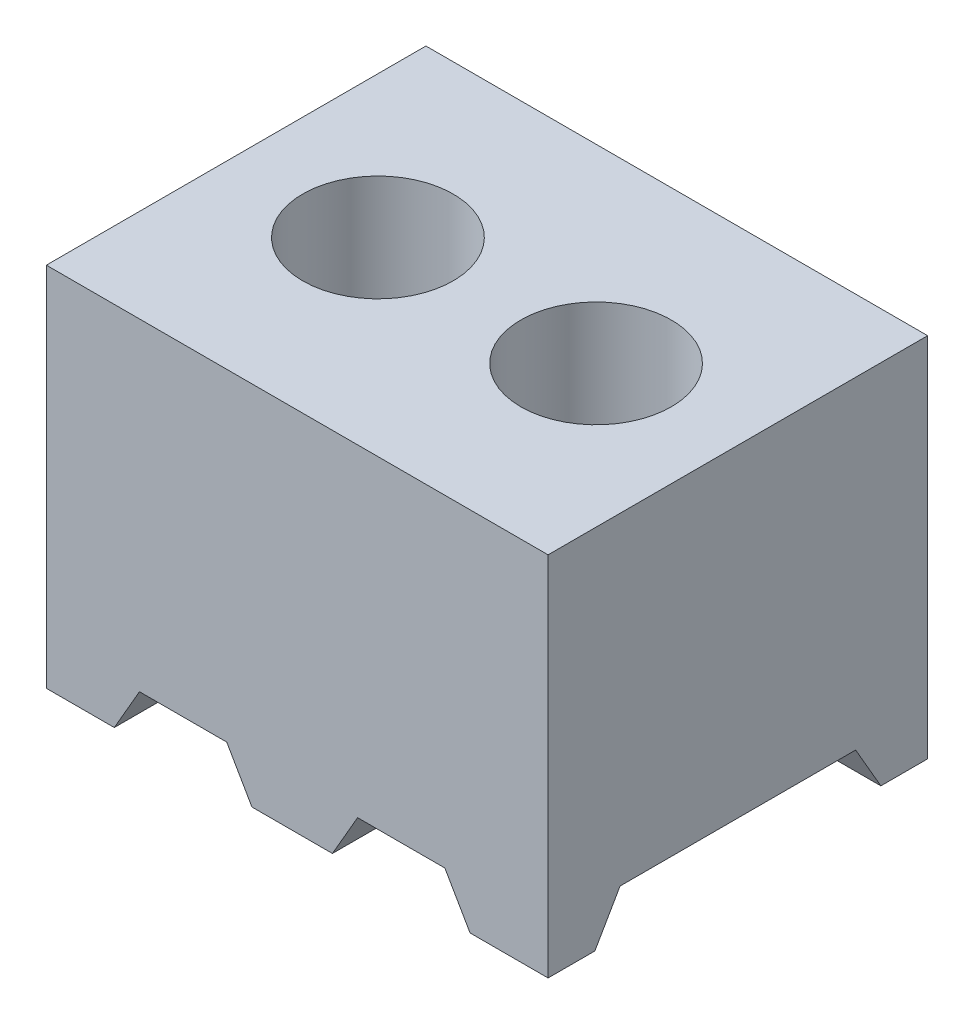
ISO-10303-21;
HEADER;
FILE_DESCRIPTION(('STEP AP214'),'2;1');
FILE_NAME('part.step','',(''),(''),'','','');
FILE_SCHEMA(('AUTOMOTIVE_DESIGN { 1 0 10303 214 1 1 1 1 }'));
ENDSEC;
DATA;
#1=APPLICATION_CONTEXT('core data for automotive mechanical design processes');
#2=APPLICATION_PROTOCOL_DEFINITION('international standard','automotive_design',2000,#1);
#3=PRODUCT_CONTEXT('',#1,'mechanical');
#4=PRODUCT('Part','Part','',(#3));
#5=PRODUCT_RELATED_PRODUCT_CATEGORY('part','',(#4));
#6=PRODUCT_DEFINITION_FORMATION('','',#4);
#7=PRODUCT_DEFINITION_CONTEXT('part definition',#1,'design');
#8=PRODUCT_DEFINITION('design','',#6,#7);
#9=PRODUCT_DEFINITION_SHAPE('','',#8);
#10=(LENGTH_UNIT() NAMED_UNIT(*) SI_UNIT(.MILLI.,.METRE.));
#11=(NAMED_UNIT(*) PLANE_ANGLE_UNIT() SI_UNIT($,.RADIAN.));
#12=(NAMED_UNIT(*) SI_UNIT($,.STERADIAN.) SOLID_ANGLE_UNIT());
#13=UNCERTAINTY_MEASURE_WITH_UNIT(LENGTH_MEASURE(1.E-05),#10,'distance_accuracy_value','');
#14=(GEOMETRIC_REPRESENTATION_CONTEXT(3) GLOBAL_UNCERTAINTY_ASSIGNED_CONTEXT((#13)) GLOBAL_UNIT_ASSIGNED_CONTEXT((#10,
#11,#12)) REPRESENTATION_CONTEXT('',''));
#15=CARTESIAN_POINT('',(0.,0.,0.));
#16=DIRECTION('',(0.,0.,1.));
#17=DIRECTION('',(1.,0.,0.));
#18=AXIS2_PLACEMENT_3D('',#15,#16,#17);
#19=CARTESIAN_POINT('',(0.,-2.1336,0.));
#20=DIRECTION('',(0.,1.,0.));
#21=DIRECTION('',(0.,0.,1.));
#22=AXIS2_PLACEMENT_3D('',#19,#20,#21);
#23=PLANE('',#22);
#24=DIRECTION('',(1.,0.,0.));
#25=VECTOR('',#24,1.);
#26=CARTESIAN_POINT('',(0.,-2.1336,0.));
#27=LINE('',#26,#25);
#28=CARTESIAN_POINT('',(2.46681757469933,-2.1336,0.));
#29=VERTEX_POINT('',#28);
#30=CARTESIAN_POINT('',(2.92099999999999,-2.1336,0.));
#31=VERTEX_POINT('',#30);
#32=EDGE_CURVE('E311',#29,#31,#27,.T.);
#33=ORIENTED_EDGE('',*,*,#32,.F.);
#34=DIRECTION('',(0.,0.,1.));
#35=VECTOR('',#34,1.);
#36=CARTESIAN_POINT('',(2.46681757469933,-2.1336,-2.2098));
#37=LINE('',#36,#35);
#38=CARTESIAN_POINT('',(2.46681757469933,-2.1336,-0.272453031625834));
#39=VERTEX_POINT('',#38);
#40=EDGE_CURVE('E215',#39,#29,#37,.T.);
#41=ORIENTED_EDGE('',*,*,#40,.F.);
#42=DIRECTION('',(1.,0.,0.));
#43=VECTOR('',#42,1.);
#44=CARTESIAN_POINT('',(0.,-2.1336,-0.272453031625834));
#45=LINE('',#44,#43);
#46=CARTESIAN_POINT('',(2.92099999999999,-2.1336,-0.272453031625834));
#47=VERTEX_POINT('',#46);
#48=EDGE_CURVE('E25',#39,#47,#45,.T.);
#49=ORIENTED_EDGE('',*,*,#48,.T.);
#50=DIRECTION('',(0.,0.,-1.));
#51=VECTOR('',#50,1.);
#52=CARTESIAN_POINT('',(2.92099999999999,-2.1336,0.));
#53=LINE('',#52,#51);
#54=EDGE_CURVE('E318',#31,#47,#53,.T.);
#55=ORIENTED_EDGE('',*,*,#54,.F.);
#56=EDGE_LOOP('',(#33,#41,#49,#55));
#57=FACE_BOUND('',#56,.T.);
#58=ADVANCED_FACE('F16',(#57),#23,.F.);
#59=DIRECTION('',(-1.,0.,0.));
#60=VECTOR('',#59,1.);
#61=CARTESIAN_POINT('',(0.,-2.1336,-1.93734696837416));
#62=LINE('',#61,#60);
#63=CARTESIAN_POINT('',(2.92099999999999,-2.1336,-1.93734696837416));
#64=VERTEX_POINT('',#63);
#65=CARTESIAN_POINT('',(2.46681757469933,-2.1336,-1.93734696837416));
#66=VERTEX_POINT('',#65);
#67=EDGE_CURVE('E344',#64,#66,#62,.T.);
#68=ORIENTED_EDGE('',*,*,#67,.T.);
#69=CARTESIAN_POINT('',(2.46681757469933,-2.1336,-2.2098));
#70=VERTEX_POINT('',#69);
#71=EDGE_CURVE('E213',#70,#66,#37,.T.);
#72=ORIENTED_EDGE('',*,*,#71,.F.);
#73=DIRECTION('',(-1.,0.,0.));
#74=VECTOR('',#73,1.);
#75=CARTESIAN_POINT('',(2.92099999999999,-2.1336,-2.20979999999999));
#76=LINE('',#75,#74);
#77=CARTESIAN_POINT('',(2.92099999999999,-2.1336,-2.20979999999999));
#78=VERTEX_POINT('',#77);
#79=EDGE_CURVE('E322',#78,#70,#76,.T.);
#80=ORIENTED_EDGE('',*,*,#79,.F.);
#81=EDGE_CURVE('E316',#64,#78,#53,.T.);
#82=ORIENTED_EDGE('',*,*,#81,.F.);
#83=EDGE_LOOP('',(#68,#72,#80,#82));
#84=FACE_BOUND('',#83,.T.);
#85=ADVANCED_FACE('F396',(#84),#23,.F.);
#86=CARTESIAN_POINT('',(-60.96,-1.8796,-0.4191));
#87=DIRECTION('',(0.,0.500000000000004,0.866025403784436));
#88=DIRECTION('',(0.,-0.866025403784436,0.500000000000004));
#89=AXIS2_PLACEMENT_3D('',#86,#87,#88);
#90=PLANE('',#89);
#91=ORIENTED_EDGE('',*,*,#48,.F.);
#92=DIRECTION('',(-0.447213595499954,0.774596669241483,-0.447213595499962));
#93=VECTOR('',#92,1.);
#94=CARTESIAN_POINT('',(-10.3358635149396,20.0412941203562,-13.075134121265));
#95=LINE('',#94,#93);
#96=CARTESIAN_POINT('',(2.32017060632517,-1.8796,-0.4191));
#97=VERTEX_POINT('',#96);
#98=EDGE_CURVE('E224',#39,#97,#95,.T.);
#99=ORIENTED_EDGE('',*,*,#98,.T.);
#100=DIRECTION('',(1.,0.,0.));
#101=VECTOR('',#100,1.);
#102=CARTESIAN_POINT('',(-60.96,-1.8796,-0.4191));
#103=LINE('',#102,#101);
#104=CARTESIAN_POINT('',(2.92099999999999,-1.8796,-0.4191));
#105=VERTEX_POINT('',#104);
#106=EDGE_CURVE('E297',#97,#105,#103,.T.);
#107=ORIENTED_EDGE('',*,*,#106,.T.);
#108=DIRECTION('',(0.,-0.866025403784436,0.500000000000004));
#109=VECTOR('',#108,1.);
#110=CARTESIAN_POINT('',(2.92099999999999,-1.8796,-0.4191));
#111=LINE('',#110,#109);
#112=EDGE_CURVE('E282',#105,#47,#111,.T.);
#113=ORIENTED_EDGE('',*,*,#112,.T.);
#114=EDGE_LOOP('',(#91,#99,#107,#113));
#115=FACE_BOUND('',#114,.T.);
#116=ADVANCED_FACE('F402',(#115),#90,.F.);
#117=CARTESIAN_POINT('',(-60.96,-1.8796,-1.7907));
#118=DIRECTION('',(0.,0.499999999999978,-0.866025403784451));
#119=DIRECTION('',(0.,0.866025403784451,0.499999999999978));
#120=AXIS2_PLACEMENT_3D('',#117,#118,#119);
#121=PLANE('',#120);
#122=DIRECTION('',(1.,0.,0.));
#123=VECTOR('',#122,1.);
#124=CARTESIAN_POINT('',(-60.96,-1.8796,-1.7907));
#125=LINE('',#124,#123);
#126=CARTESIAN_POINT('',(2.32017060632517,-1.8796,-1.7907));
#127=VERTEX_POINT('',#126);
#128=CARTESIAN_POINT('',(2.92099999999999,-1.8796,-1.7907));
#129=VERTEX_POINT('',#128);
#130=EDGE_CURVE('E291',#127,#129,#125,.T.);
#131=ORIENTED_EDGE('',*,*,#130,.F.);
#132=DIRECTION('',(0.44721359549996,-0.774596669241494,-0.447213595499938));
#133=VECTOR('',#132,1.);
#134=CARTESIAN_POINT('',(-10.33586351494,20.0412941203568,10.8653341212645));
#135=LINE('',#134,#133);
#136=EDGE_CURVE('E221',#127,#66,#135,.T.);
#137=ORIENTED_EDGE('',*,*,#136,.T.);
#138=ORIENTED_EDGE('',*,*,#67,.F.);
#139=DIRECTION('',(0.,0.866025403784451,0.499999999999978));
#140=VECTOR('',#139,1.);
#141=CARTESIAN_POINT('',(2.92099999999999,-1.8796,-1.7907));
#142=LINE('',#141,#140);
#143=EDGE_CURVE('E285',#64,#129,#142,.T.);
#144=ORIENTED_EDGE('',*,*,#143,.T.);
#145=EDGE_LOOP('',(#131,#137,#138,#144));
#146=FACE_BOUND('',#145,.T.);
#147=ADVANCED_FACE('F427',(#146),#121,.F.);
#148=CARTESIAN_POINT('',(1.19681757469933,-2.1336,-0.272453031625834));
#149=VERTEX_POINT('',#148);
#150=CARTESIAN_POINT('',(1.665523637951,-2.1336,-0.272453031625838));
#151=VERTEX_POINT('',#150);
#152=EDGE_CURVE('E24',#149,#151,#45,.T.);
#153=ORIENTED_EDGE('',*,*,#152,.T.);
#154=DIRECTION('',(0.,0.,1.));
#155=VECTOR('',#154,1.);
#156=CARTESIAN_POINT('',(1.665523637951,-2.1336,-2.2098));
#157=LINE('',#156,#155);
#158=CARTESIAN_POINT('',(1.665523637951,-2.1336,0.));
#159=VERTEX_POINT('',#158);
#160=EDGE_CURVE('E189',#151,#159,#157,.T.);
#161=ORIENTED_EDGE('',*,*,#160,.T.);
#162=CARTESIAN_POINT('',(1.19681757469933,-2.1336,0.));
#163=VERTEX_POINT('',#162);
#164=EDGE_CURVE('E317',#163,#159,#27,.T.);
#165=ORIENTED_EDGE('',*,*,#164,.F.);
#166=DIRECTION('',(0.,0.,1.));
#167=VECTOR('',#166,1.);
#168=CARTESIAN_POINT('',(1.19681757469933,-2.1336,-2.2098));
#169=LINE('',#168,#167);
#170=EDGE_CURVE('E252',#149,#163,#169,.T.);
#171=ORIENTED_EDGE('',*,*,#170,.F.);
#172=EDGE_LOOP('',(#153,#161,#165,#171));
#173=FACE_BOUND('',#172,.T.);
#174=ADVANCED_FACE('F403',(#173),#23,.F.);
#175=CARTESIAN_POINT('',(1.665523637951,-2.1336,-2.2098));
#176=VERTEX_POINT('',#175);
#177=CARTESIAN_POINT('',(1.19681757469933,-2.1336,-2.2098));
#178=VERTEX_POINT('',#177);
#179=EDGE_CURVE('E325',#176,#178,#76,.T.);
#180=ORIENTED_EDGE('',*,*,#179,.F.);
#181=CARTESIAN_POINT('',(1.665523637951,-2.1336,-1.93734696837416));
#182=VERTEX_POINT('',#181);
#183=EDGE_CURVE('E32',#176,#182,#157,.T.);
#184=ORIENTED_EDGE('',*,*,#183,.T.);
#185=CARTESIAN_POINT('',(1.19681757469933,-2.1336,-1.93734696837416));
#186=VERTEX_POINT('',#185);
#187=EDGE_CURVE('E346',#182,#186,#62,.T.);
#188=ORIENTED_EDGE('',*,*,#187,.T.);
#189=EDGE_CURVE('E249',#178,#186,#169,.T.);
#190=ORIENTED_EDGE('',*,*,#189,.F.);
#191=EDGE_LOOP('',(#180,#184,#188,#190));
#192=FACE_BOUND('',#191,.T.);
#193=ADVANCED_FACE('F373',(#192),#23,.F.);
#194=CARTESIAN_POINT('',(1.05017060632517,-1.8796,-0.4191));
#195=VERTEX_POINT('',#194);
#196=CARTESIAN_POINT('',(1.81217060632517,-1.8796,-0.4191));
#197=VERTEX_POINT('',#196);
#198=EDGE_CURVE('E296',#195,#197,#103,.T.);
#199=ORIENTED_EDGE('',*,*,#198,.T.);
#200=DIRECTION('',(-0.447213595499954,-0.774596669241483,0.447213595499963));
#201=VECTOR('',#200,1.);
#202=CARTESIAN_POINT('',(-10.7422635149396,-23.6245177583072,12.135334121265));
#203=LINE('',#202,#201);
#204=EDGE_CURVE('E218',#197,#151,#203,.T.);
#205=ORIENTED_EDGE('',*,*,#204,.T.);
#206=ORIENTED_EDGE('',*,*,#152,.F.);
#207=DIRECTION('',(-0.447213595499954,0.774596669241483,-0.447213595499962));
#208=VECTOR('',#207,1.);
#209=CARTESIAN_POINT('',(-11.3518635149396,19.6013532152337,-12.8211341212651));
#210=LINE('',#209,#208);
#211=EDGE_CURVE('E267',#149,#195,#210,.T.);
#212=ORIENTED_EDGE('',*,*,#211,.T.);
#213=EDGE_LOOP('',(#199,#205,#206,#212));
#214=FACE_BOUND('',#213,.T.);
#215=ADVANCED_FACE('F425',(#214),#90,.F.);
#216=ORIENTED_EDGE('',*,*,#187,.F.);
#217=DIRECTION('',(0.44721359549996,0.774596669241494,0.447213595499938));
#218=VECTOR('',#217,1.);
#219=CARTESIAN_POINT('',(-10.74226351494,-23.6245177583078,-14.3451341212645));
#220=LINE('',#219,#218);
#221=CARTESIAN_POINT('',(1.81217060632517,-1.8796,-1.7907));
#222=VERTEX_POINT('',#221);
#223=EDGE_CURVE('E211',#182,#222,#220,.T.);
#224=ORIENTED_EDGE('',*,*,#223,.T.);
#225=CARTESIAN_POINT('',(1.05017060632517,-1.8796,-1.7907));
#226=VERTEX_POINT('',#225);
#227=EDGE_CURVE('E187',#226,#222,#125,.T.);
#228=ORIENTED_EDGE('',*,*,#227,.F.);
#229=DIRECTION('',(0.44721359549996,-0.774596669241494,-0.447213595499938));
#230=VECTOR('',#229,1.);
#231=CARTESIAN_POINT('',(-11.35186351494,19.6013532152343,10.6113341212645));
#232=LINE('',#231,#230);
#233=EDGE_CURVE('E264',#226,#186,#232,.T.);
#234=ORIENTED_EDGE('',*,*,#233,.T.);
#235=EDGE_LOOP('',(#216,#224,#228,#234));
#236=FACE_BOUND('',#235,.T.);
#237=ADVANCED_FACE('F376',(#236),#121,.F.);
#238=CARTESIAN_POINT('',(0.,-2.1336,-0.272453031625834));
#239=VERTEX_POINT('',#238);
#240=CARTESIAN_POINT('',(0.395523637951008,-2.1336,-0.272453031625833));
#241=VERTEX_POINT('',#240);
#242=EDGE_CURVE('E10',#239,#241,#45,.T.);
#243=ORIENTED_EDGE('',*,*,#242,.T.);
#244=DIRECTION('',(0.,0.,1.));
#245=VECTOR('',#244,1.);
#246=CARTESIAN_POINT('',(0.395523637951004,-2.1336,-2.2098));
#247=LINE('',#246,#245);
#248=CARTESIAN_POINT('',(0.395523637951004,-2.1336,0.));
#249=VERTEX_POINT('',#248);
#250=EDGE_CURVE('E256',#241,#249,#247,.T.);
#251=ORIENTED_EDGE('',*,*,#250,.T.);
#252=CARTESIAN_POINT('',(0.,-2.1336,0.));
#253=VERTEX_POINT('',#252);
#254=EDGE_CURVE('E313',#253,#249,#27,.T.);
#255=ORIENTED_EDGE('',*,*,#254,.F.);
#256=DIRECTION('',(0.,0.,1.));
#257=VECTOR('',#256,1.);
#258=CARTESIAN_POINT('',(0.,-2.1336,-2.2098));
#259=LINE('',#258,#257);
#260=EDGE_CURVE('E312',#239,#253,#259,.T.);
#261=ORIENTED_EDGE('',*,*,#260,.F.);
#262=EDGE_LOOP('',(#243,#251,#255,#261));
#263=FACE_BOUND('',#262,.T.);
#264=ADVANCED_FACE('F410',(#263),#23,.F.);
#265=CARTESIAN_POINT('',(0.,-2.1336,-2.2098));
#266=DIRECTION('',(-1.,0.,0.));
#267=DIRECTION('',(0.,0.,1.));
#268=AXIS2_PLACEMENT_3D('',#265,#266,#267);
#269=PLANE('',#268);
#270=DIRECTION('',(0.,0.866025403784436,-0.500000000000004));
#271=VECTOR('',#270,1.);
#272=CARTESIAN_POINT('',(0.,-1.2947041547216,-0.756789773719383));
#273=LINE('',#272,#271);
#274=CARTESIAN_POINT('',(0.,-1.8796,-0.4191));
#275=VERTEX_POINT('',#274);
#276=EDGE_CURVE('E303',#239,#275,#273,.T.);
#277=ORIENTED_EDGE('',*,*,#276,.F.);
#278=ORIENTED_EDGE('',*,*,#260,.T.);
#279=DIRECTION('',(0.,1.,0.));
#280=VECTOR('',#279,1.);
#281=CARTESIAN_POINT('',(0.,-2.1336,0.));
#282=LINE('',#281,#280);
#283=CARTESIAN_POINT('',(0.,0.,0.));
#284=VERTEX_POINT('',#283);
#285=EDGE_CURVE('E324',#253,#284,#282,.T.);
#286=ORIENTED_EDGE('',*,*,#285,.T.);
#287=DIRECTION('',(0.,0.,1.));
#288=VECTOR('',#287,1.);
#289=CARTESIAN_POINT('',(0.,0.,-2.2098));
#290=LINE('',#289,#288);
#291=CARTESIAN_POINT('',(0.,0.,-2.2098));
#292=VERTEX_POINT('',#291);
#293=EDGE_CURVE('E307',#292,#284,#290,.T.);
#294=ORIENTED_EDGE('',*,*,#293,.F.);
#295=DIRECTION('',(0.,1.,0.));
#296=VECTOR('',#295,1.);
#297=CARTESIAN_POINT('',(0.,-2.1336,-2.2098));
#298=LINE('',#297,#296);
#299=CARTESIAN_POINT('',(0.,-2.1336,-2.2098));
#300=VERTEX_POINT('',#299);
#301=EDGE_CURVE('E337',#300,#292,#298,.T.);
#302=ORIENTED_EDGE('',*,*,#301,.F.);
#303=CARTESIAN_POINT('',(0.,-2.1336,-1.93734696837416));
#304=VERTEX_POINT('',#303);
#305=EDGE_CURVE('E308',#300,#304,#259,.T.);
#306=ORIENTED_EDGE('',*,*,#305,.T.);
#307=DIRECTION('',(0.,-0.866025403784451,-0.499999999999978));
#308=VECTOR('',#307,1.);
#309=CARTESIAN_POINT('',(0.,-2.25157562336303,-2.00546022628061));
#310=LINE('',#309,#308);
#311=CARTESIAN_POINT('',(0.,-1.8796,-1.7907));
#312=VERTEX_POINT('',#311);
#313=EDGE_CURVE('E295',#312,#304,#310,.T.);
#314=ORIENTED_EDGE('',*,*,#313,.F.);
#315=DIRECTION('',(0.,0.,-1.));
#316=VECTOR('',#315,1.);
#317=CARTESIAN_POINT('',(0.,-1.8796,-2.2098));
#318=LINE('',#317,#316);
#319=EDGE_CURVE('E305',#275,#312,#318,.T.);
#320=ORIENTED_EDGE('',*,*,#319,.F.);
#321=EDGE_LOOP('',(#277,#278,#286,#294,#302,#306,#314,#320));
#322=FACE_BOUND('',#321,.T.);
#323=ADVANCED_FACE('F18',(#322),#269,.T.);
#324=CARTESIAN_POINT('',(2.92099999999999,-2.1336,-2.20979999999999));
#325=DIRECTION('',(0.,0.,-1.));
#326=DIRECTION('',(-1.,0.,0.));
#327=AXIS2_PLACEMENT_3D('',#324,#325,#326);
#328=PLANE('',#327);
#329=DIRECTION('',(-0.499999999999997,0.86602540378444,0.));
#330=VECTOR('',#329,1.);
#331=CARTESIAN_POINT('',(2.46681757469933,-2.1336,-2.2098));
#332=LINE('',#331,#330);
#333=CARTESIAN_POINT('',(2.32017060632517,-1.8796,-2.2098));
#334=VERTEX_POINT('',#333);
#335=EDGE_CURVE('E196',#70,#334,#332,.T.);
#336=ORIENTED_EDGE('',*,*,#335,.T.);
#337=DIRECTION('',(-1.,0.,0.));
#338=VECTOR('',#337,1.);
#339=CARTESIAN_POINT('',(1.81217060632517,-1.8796,-2.2098));
#340=LINE('',#339,#338);
#341=CARTESIAN_POINT('',(1.81217060632517,-1.8796,-2.2098));
#342=VERTEX_POINT('',#341);
#343=EDGE_CURVE('E183',#334,#342,#340,.T.);
#344=ORIENTED_EDGE('',*,*,#343,.T.);
#345=DIRECTION('',(-0.499999999999996,-0.866025403784441,0.));
#346=VECTOR('',#345,1.);
#347=CARTESIAN_POINT('',(1.665523637951,-2.1336,-2.2098));
#348=LINE('',#347,#346);
#349=EDGE_CURVE('E192',#342,#176,#348,.T.);
#350=ORIENTED_EDGE('',*,*,#349,.T.);
#351=ORIENTED_EDGE('',*,*,#179,.T.);
#352=DIRECTION('',(-0.499999999999997,0.86602540378444,0.));
#353=VECTOR('',#352,1.);
#354=CARTESIAN_POINT('',(1.19681757469933,-2.1336,-2.2098));
#355=LINE('',#354,#353);
#356=CARTESIAN_POINT('',(1.05017060632517,-1.8796,-2.2098));
#357=VERTEX_POINT('',#356);
#358=EDGE_CURVE('E235',#178,#357,#355,.T.);
#359=ORIENTED_EDGE('',*,*,#358,.T.);
#360=DIRECTION('',(-1.,0.,0.));
#361=VECTOR('',#360,1.);
#362=CARTESIAN_POINT('',(0.542170606325168,-1.8796,-2.2098));
#363=LINE('',#362,#361);
#364=CARTESIAN_POINT('',(0.542170606325168,-1.8796,-2.2098));
#365=VERTEX_POINT('',#364);
#366=EDGE_CURVE('E228',#357,#365,#363,.T.);
#367=ORIENTED_EDGE('',*,*,#366,.T.);
#368=DIRECTION('',(-0.499999999999996,-0.866025403784441,0.));
#369=VECTOR('',#368,1.);
#370=CARTESIAN_POINT('',(0.395523637951004,-2.1336,-2.2098));
#371=LINE('',#370,#369);
#372=CARTESIAN_POINT('',(0.395523637951004,-2.1336,-2.2098));
#373=VERTEX_POINT('',#372);
#374=EDGE_CURVE('E231',#365,#373,#371,.T.);
#375=ORIENTED_EDGE('',*,*,#374,.T.);
#376=EDGE_CURVE('E321',#373,#300,#76,.T.);
#377=ORIENTED_EDGE('',*,*,#376,.T.);
#378=ORIENTED_EDGE('',*,*,#301,.T.);
#379=DIRECTION('',(-1.,0.,0.));
#380=VECTOR('',#379,1.);
#381=CARTESIAN_POINT('',(2.92099999999999,0.,-2.20979999999999));
#382=LINE('',#381,#380);
#383=CARTESIAN_POINT('',(2.92099999999999,0.,-2.20979999999999));
#384=VERTEX_POINT('',#383);
#385=EDGE_CURVE('E334',#384,#292,#382,.T.);
#386=ORIENTED_EDGE('',*,*,#385,.F.);
#387=DIRECTION('',(0.,1.,0.));
#388=VECTOR('',#387,1.);
#389=CARTESIAN_POINT('',(2.92099999999999,-2.1336,-2.20979999999999));
#390=LINE('',#389,#388);
#391=EDGE_CURVE('E340',#78,#384,#390,.T.);
#392=ORIENTED_EDGE('',*,*,#391,.F.);
#393=ORIENTED_EDGE('',*,*,#79,.T.);
#394=EDGE_LOOP('',(#336,#344,#350,#351,#359,#367,#375,#377,#378,#386,#392,#393));
#395=FACE_BOUND('',#394,.T.);
#396=ADVANCED_FACE('F198',(#395),#328,.T.);
#397=CARTESIAN_POINT('',(2.92099999999999,-2.1336,0.));
#398=DIRECTION('',(1.,0.,0.));
#399=DIRECTION('',(0.,0.,-1.));
#400=AXIS2_PLACEMENT_3D('',#397,#398,#399);
#401=PLANE('',#400);
#402=ORIENTED_EDGE('',*,*,#112,.F.);
#403=DIRECTION('',(0.,0.,1.));
#404=VECTOR('',#403,1.);
#405=CARTESIAN_POINT('',(2.92099999999999,-1.8796,-0.4191));
#406=LINE('',#405,#404);
#407=EDGE_CURVE('E288',#129,#105,#406,.T.);
#408=ORIENTED_EDGE('',*,*,#407,.F.);
#409=ORIENTED_EDGE('',*,*,#143,.F.);
#410=ORIENTED_EDGE('',*,*,#81,.T.);
#411=ORIENTED_EDGE('',*,*,#391,.T.);
#412=DIRECTION('',(0.,0.,-1.));
#413=VECTOR('',#412,1.);
#414=CARTESIAN_POINT('',(2.92099999999999,0.,0.));
#415=LINE('',#414,#413);
#416=CARTESIAN_POINT('',(2.92099999999999,0.,0.));
#417=VERTEX_POINT('',#416);
#418=EDGE_CURVE('E331',#417,#384,#415,.T.);
#419=ORIENTED_EDGE('',*,*,#418,.F.);
#420=DIRECTION('',(0.,1.,0.));
#421=VECTOR('',#420,1.);
#422=CARTESIAN_POINT('',(2.92099999999999,-2.1336,0.));
#423=LINE('',#422,#421);
#424=EDGE_CURVE('E342',#31,#417,#423,.T.);
#425=ORIENTED_EDGE('',*,*,#424,.F.);
#426=ORIENTED_EDGE('',*,*,#54,.T.);
#427=EDGE_LOOP('',(#402,#408,#409,#410,#411,#419,#425,#426));
#428=FACE_BOUND('',#427,.T.);
#429=ADVANCED_FACE('F417',(#428),#401,.T.);
#430=CARTESIAN_POINT('',(0.,-2.1336,0.));
#431=DIRECTION('',(0.,0.,1.));
#432=DIRECTION('',(1.,0.,0.));
#433=AXIS2_PLACEMENT_3D('',#430,#431,#432);
#434=PLANE('',#433);
#435=DIRECTION('',(-0.499999999999997,0.86602540378444,0.));
#436=VECTOR('',#435,1.);
#437=CARTESIAN_POINT('',(2.46681757469933,-2.1336,0.));
#438=LINE('',#437,#436);
#439=CARTESIAN_POINT('',(2.32017060632517,-1.8796,0.));
#440=VERTEX_POINT('',#439);
#441=EDGE_CURVE('E200',#29,#440,#438,.T.);
#442=ORIENTED_EDGE('',*,*,#441,.F.);
#443=ORIENTED_EDGE('',*,*,#32,.T.);
#444=ORIENTED_EDGE('',*,*,#424,.T.);
#445=DIRECTION('',(1.,0.,0.));
#446=VECTOR('',#445,1.);
#447=CARTESIAN_POINT('',(0.,0.,0.));
#448=LINE('',#447,#446);
#449=EDGE_CURVE('E328',#284,#417,#448,.T.);
#450=ORIENTED_EDGE('',*,*,#449,.F.);
#451=ORIENTED_EDGE('',*,*,#285,.F.);
#452=ORIENTED_EDGE('',*,*,#254,.T.);
#453=DIRECTION('',(-0.499999999999996,-0.866025403784441,0.));
#454=VECTOR('',#453,1.);
#455=CARTESIAN_POINT('',(0.395523637951004,-2.1336,0.));
#456=LINE('',#455,#454);
#457=CARTESIAN_POINT('',(0.542170606325168,-1.8796,0.));
#458=VERTEX_POINT('',#457);
#459=EDGE_CURVE('E241',#458,#249,#456,.T.);
#460=ORIENTED_EDGE('',*,*,#459,.F.);
#461=DIRECTION('',(-1.,0.,0.));
#462=VECTOR('',#461,1.);
#463=CARTESIAN_POINT('',(0.542170606325168,-1.8796,0.));
#464=LINE('',#463,#462);
#465=CARTESIAN_POINT('',(1.05017060632517,-1.8796,0.));
#466=VERTEX_POINT('',#465);
#467=EDGE_CURVE('E227',#466,#458,#464,.T.);
#468=ORIENTED_EDGE('',*,*,#467,.F.);
#469=DIRECTION('',(-0.499999999999997,0.86602540378444,0.));
#470=VECTOR('',#469,1.);
#471=CARTESIAN_POINT('',(1.19681757469933,-2.1336,0.));
#472=LINE('',#471,#470);
#473=EDGE_CURVE('E232',#163,#466,#472,.T.);
#474=ORIENTED_EDGE('',*,*,#473,.F.);
#475=ORIENTED_EDGE('',*,*,#164,.T.);
#476=DIRECTION('',(-0.499999999999996,-0.866025403784441,0.));
#477=VECTOR('',#476,1.);
#478=CARTESIAN_POINT('',(1.665523637951,-2.1336,0.));
#479=LINE('',#478,#477);
#480=CARTESIAN_POINT('',(1.81217060632517,-1.8796,0.));
#481=VERTEX_POINT('',#480);
#482=EDGE_CURVE('E203',#481,#159,#479,.T.);
#483=ORIENTED_EDGE('',*,*,#482,.F.);
#484=DIRECTION('',(-1.,0.,0.));
#485=VECTOR('',#484,1.);
#486=CARTESIAN_POINT('',(1.81217060632517,-1.8796,0.));
#487=LINE('',#486,#485);
#488=EDGE_CURVE('E40',#440,#481,#487,.T.);
#489=ORIENTED_EDGE('',*,*,#488,.F.);
#490=EDGE_LOOP('',(#442,#443,#444,#450,#451,#452,#460,#468,#474,#475,#483,#489));
#491=FACE_BOUND('',#490,.T.);
#492=ADVANCED_FACE('F409',(#491),#434,.T.);
#493=ORIENTED_EDGE('',*,*,#376,.F.);
#494=CARTESIAN_POINT('',(0.395523637951003,-2.1336,-1.93734696837416));
#495=VERTEX_POINT('',#494);
#496=EDGE_CURVE('E253',#373,#495,#247,.T.);
#497=ORIENTED_EDGE('',*,*,#496,.T.);
#498=EDGE_CURVE('E339',#495,#304,#62,.T.);
#499=ORIENTED_EDGE('',*,*,#498,.T.);
#500=ORIENTED_EDGE('',*,*,#305,.F.);
#501=EDGE_LOOP('',(#493,#497,#499,#500));
#502=FACE_BOUND('',#501,.T.);
#503=ADVANCED_FACE('F354',(#502),#23,.F.);
#504=CARTESIAN_POINT('',(0.,0.,0.));
#505=DIRECTION('',(0.,1.,0.));
#506=DIRECTION('',(0.,0.,1.));
#507=AXIS2_PLACEMENT_3D('',#504,#505,#506);
#508=PLANE('',#507);
#509=CARTESIAN_POINT('',(2.09550000000001,0.,-1.1049));
#510=DIRECTION('',(0.,1.,0.));
#511=DIRECTION('',(0.,0.,1.));
#512=AXIS2_PLACEMENT_3D('',#509,#510,#511);
#513=CIRCLE('',#512,0.438150000000013);
#514=CARTESIAN_POINT('',(2.09550000000001,0.,-0.666749999999983));
#515=VERTEX_POINT('',#514);
#516=EDGE_CURVE('E270',#515,#515,#513,.T.);
#517=ORIENTED_EDGE('',*,*,#516,.F.);
#518=EDGE_LOOP('',(#517));
#519=FACE_BOUND('',#518,.T.);
#520=CARTESIAN_POINT('',(0.825500000000005,0.,-1.1049));
#521=DIRECTION('',(0.,1.,0.));
#522=DIRECTION('',(0.,0.,1.));
#523=AXIS2_PLACEMENT_3D('',#520,#521,#522);
#524=CIRCLE('',#523,0.438150000000013);
#525=CARTESIAN_POINT('',(0.825500000000005,0.,-0.666749999999987));
#526=VERTEX_POINT('',#525);
#527=EDGE_CURVE('E276',#526,#526,#524,.T.);
#528=ORIENTED_EDGE('',*,*,#527,.F.);
#529=EDGE_LOOP('',(#528));
#530=FACE_BOUND('',#529,.T.);
#531=ORIENTED_EDGE('',*,*,#293,.T.);
#532=ORIENTED_EDGE('',*,*,#449,.T.);
#533=ORIENTED_EDGE('',*,*,#418,.T.);
#534=ORIENTED_EDGE('',*,*,#385,.T.);
#535=EDGE_LOOP('',(#531,#532,#533,#534));
#536=FACE_BOUND('',#535,.T.);
#537=ADVANCED_FACE('F408',(#519,#530,#536),#508,.T.);
#538=CARTESIAN_POINT('',(0.542170606325168,-1.8796,-0.4191));
#539=VERTEX_POINT('',#538);
#540=EDGE_CURVE('E292',#275,#539,#103,.T.);
#541=ORIENTED_EDGE('',*,*,#540,.T.);
#542=DIRECTION('',(-0.447213595499954,-0.774596669241483,0.447213595499963));
#543=VECTOR('',#542,1.);
#544=CARTESIAN_POINT('',(-11.7582635149396,-23.1845768531847,11.881334121265));
#545=LINE('',#544,#543);
#546=EDGE_CURVE('E261',#539,#241,#545,.T.);
#547=ORIENTED_EDGE('',*,*,#546,.T.);
#548=ORIENTED_EDGE('',*,*,#242,.F.);
#549=ORIENTED_EDGE('',*,*,#276,.T.);
#550=EDGE_LOOP('',(#541,#547,#548,#549));
#551=FACE_BOUND('',#550,.T.);
#552=ADVANCED_FACE('F415',(#551),#90,.F.);
#553=CARTESIAN_POINT('',(-60.96,-1.8796,-0.4191));
#554=DIRECTION('',(0.,1.,0.));
#555=DIRECTION('',(0.,0.,1.));
#556=AXIS2_PLACEMENT_3D('',#553,#554,#555);
#557=PLANE('',#556);
#558=CARTESIAN_POINT('',(2.09550000000001,-1.8796,-1.1049));
#559=DIRECTION('',(0.,1.,0.));
#560=DIRECTION('',(0.,0.,1.));
#561=AXIS2_PLACEMENT_3D('',#558,#559,#560);
#562=CIRCLE('',#561,0.438150000000013);
#563=CARTESIAN_POINT('',(2.09550000000001,-1.8796,-0.666749999999983));
#564=VERTEX_POINT('',#563);
#565=EDGE_CURVE('E273',#564,#564,#562,.T.);
#566=ORIENTED_EDGE('',*,*,#565,.T.);
#567=EDGE_LOOP('',(#566));
#568=FACE_BOUND('',#567,.T.);
#569=CARTESIAN_POINT('',(0.825500000000005,-1.8796,-1.1049));
#570=DIRECTION('',(0.,1.,0.));
#571=DIRECTION('',(0.,0.,1.));
#572=AXIS2_PLACEMENT_3D('',#569,#570,#571);
#573=CIRCLE('',#572,0.438150000000013);
#574=CARTESIAN_POINT('',(0.825500000000005,-1.8796,-0.666749999999987));
#575=VERTEX_POINT('',#574);
#576=EDGE_CURVE('E279',#575,#575,#573,.T.);
#577=ORIENTED_EDGE('',*,*,#576,.T.);
#578=EDGE_LOOP('',(#577));
#579=FACE_BOUND('',#578,.T.);
#580=ORIENTED_EDGE('',*,*,#227,.T.);
#581=DIRECTION('',(0.,0.,1.));
#582=VECTOR('',#581,1.);
#583=CARTESIAN_POINT('',(1.81217060632517,-1.8796,-2.2098));
#584=LINE('',#583,#582);
#585=EDGE_CURVE('E179',#342,#222,#584,.T.);
#586=ORIENTED_EDGE('',*,*,#585,.F.);
#587=ORIENTED_EDGE('',*,*,#343,.F.);
#588=DIRECTION('',(0.,0.,1.));
#589=VECTOR('',#588,1.);
#590=CARTESIAN_POINT('',(2.32017060632517,-1.8796,-2.2098));
#591=LINE('',#590,#589);
#592=EDGE_CURVE('E209',#334,#127,#591,.T.);
#593=ORIENTED_EDGE('',*,*,#592,.T.);
#594=ORIENTED_EDGE('',*,*,#130,.T.);
#595=ORIENTED_EDGE('',*,*,#407,.T.);
#596=ORIENTED_EDGE('',*,*,#106,.F.);
#597=EDGE_CURVE('E212',#97,#440,#591,.T.);
#598=ORIENTED_EDGE('',*,*,#597,.T.);
#599=ORIENTED_EDGE('',*,*,#488,.T.);
#600=EDGE_CURVE('E190',#197,#481,#584,.T.);
#601=ORIENTED_EDGE('',*,*,#600,.F.);
#602=ORIENTED_EDGE('',*,*,#198,.F.);
#603=DIRECTION('',(0.,0.,1.));
#604=VECTOR('',#603,1.);
#605=CARTESIAN_POINT('',(1.05017060632517,-1.8796,-2.2098));
#606=LINE('',#605,#604);
#607=EDGE_CURVE('E248',#195,#466,#606,.T.);
#608=ORIENTED_EDGE('',*,*,#607,.T.);
#609=ORIENTED_EDGE('',*,*,#467,.T.);
#610=DIRECTION('',(0.,0.,1.));
#611=VECTOR('',#610,1.);
#612=CARTESIAN_POINT('',(0.542170606325168,-1.8796,-2.2098));
#613=LINE('',#612,#611);
#614=EDGE_CURVE('E238',#539,#458,#613,.T.);
#615=ORIENTED_EDGE('',*,*,#614,.F.);
#616=ORIENTED_EDGE('',*,*,#540,.F.);
#617=ORIENTED_EDGE('',*,*,#319,.T.);
#618=CARTESIAN_POINT('',(0.542170606325169,-1.8796,-1.7907));
#619=VERTEX_POINT('',#618);
#620=EDGE_CURVE('E298',#312,#619,#125,.T.);
#621=ORIENTED_EDGE('',*,*,#620,.T.);
#622=EDGE_CURVE('E257',#365,#619,#613,.T.);
#623=ORIENTED_EDGE('',*,*,#622,.F.);
#624=ORIENTED_EDGE('',*,*,#366,.F.);
#625=EDGE_CURVE('E245',#357,#226,#606,.T.);
#626=ORIENTED_EDGE('',*,*,#625,.T.);
#627=EDGE_LOOP('',(#580,#586,#587,#593,#594,#595,#596,#598,#599,#601,#602,#608,#609,#615,#616,
#617,#621,#623,#624,#626));
#628=FACE_BOUND('',#627,.T.);
#629=ADVANCED_FACE('F180',(#568,#579,#628),#557,.F.);
#630=ORIENTED_EDGE('',*,*,#498,.F.);
#631=DIRECTION('',(0.44721359549996,0.774596669241494,0.447213595499938));
#632=VECTOR('',#631,1.);
#633=CARTESIAN_POINT('',(-11.75826351494,-23.1845768531853,-14.0911341212645));
#634=LINE('',#633,#632);
#635=EDGE_CURVE('E247',#495,#619,#634,.T.);
#636=ORIENTED_EDGE('',*,*,#635,.T.);
#637=ORIENTED_EDGE('',*,*,#620,.F.);
#638=ORIENTED_EDGE('',*,*,#313,.T.);
#639=EDGE_LOOP('',(#630,#636,#637,#638));
#640=FACE_BOUND('',#639,.T.);
#641=ADVANCED_FACE('F358',(#640),#121,.F.);
#642=CARTESIAN_POINT('',(0.825500000000005,0.,-1.1049));
#643=DIRECTION('',(0.,1.,0.));
#644=DIRECTION('',(0.,0.,1.));
#645=AXIS2_PLACEMENT_3D('',#642,#643,#644);
#646=CYLINDRICAL_SURFACE('',#645,0.438150000000013);
#647=ORIENTED_EDGE('',*,*,#527,.T.);
#648=EDGE_LOOP('',(#647));
#649=FACE_BOUND('',#648,.T.);
#650=ORIENTED_EDGE('',*,*,#576,.F.);
#651=EDGE_LOOP('',(#650));
#652=FACE_BOUND('',#651,.T.);
#653=ADVANCED_FACE('F602',(#649,#652),#646,.F.);
#654=CARTESIAN_POINT('',(2.09550000000001,0.,-1.1049));
#655=DIRECTION('',(0.,1.,0.));
#656=DIRECTION('',(0.,0.,1.));
#657=AXIS2_PLACEMENT_3D('',#654,#655,#656);
#658=CYLINDRICAL_SURFACE('',#657,0.438150000000013);
#659=ORIENTED_EDGE('',*,*,#516,.T.);
#660=EDGE_LOOP('',(#659));
#661=FACE_BOUND('',#660,.T.);
#662=ORIENTED_EDGE('',*,*,#565,.F.);
#663=EDGE_LOOP('',(#662));
#664=FACE_BOUND('',#663,.T.);
#665=ADVANCED_FACE('F390',(#661,#664),#658,.F.);
#666=CARTESIAN_POINT('',(1.19681757469933,-2.1336,-2.2098));
#667=DIRECTION('',(0.866025403784441,0.499999999999997,0.));
#668=DIRECTION('',(-0.499999999999997,0.866025403784441,0.));
#669=AXIS2_PLACEMENT_3D('',#666,#667,#668);
#670=PLANE('',#669);
#671=ORIENTED_EDGE('',*,*,#625,.F.);
#672=ORIENTED_EDGE('',*,*,#358,.F.);
#673=ORIENTED_EDGE('',*,*,#189,.T.);
#674=ORIENTED_EDGE('',*,*,#233,.F.);
#675=EDGE_LOOP('',(#671,#672,#673,#674));
#676=FACE_BOUND('',#675,.T.);
#677=ADVANCED_FACE('F371',(#676),#670,.F.);
#678=CARTESIAN_POINT('',(0.395523637951004,-2.1336,-2.2098));
#679=DIRECTION('',(-0.866025403784441,0.499999999999996,0.));
#680=DIRECTION('',(-0.499999999999996,-0.866025403784441,0.));
#681=AXIS2_PLACEMENT_3D('',#678,#679,#680);
#682=PLANE('',#681);
#683=ORIENTED_EDGE('',*,*,#496,.F.);
#684=ORIENTED_EDGE('',*,*,#374,.F.);
#685=ORIENTED_EDGE('',*,*,#622,.T.);
#686=ORIENTED_EDGE('',*,*,#635,.F.);
#687=EDGE_LOOP('',(#683,#684,#685,#686));
#688=FACE_BOUND('',#687,.T.);
#689=ADVANCED_FACE('F378',(#688),#682,.F.);
#690=ORIENTED_EDGE('',*,*,#170,.T.);
#691=ORIENTED_EDGE('',*,*,#473,.T.);
#692=ORIENTED_EDGE('',*,*,#607,.F.);
#693=ORIENTED_EDGE('',*,*,#211,.F.);
#694=EDGE_LOOP('',(#690,#691,#692,#693));
#695=FACE_BOUND('',#694,.T.);
#696=ADVANCED_FACE('F380',(#695),#670,.F.);
#697=ORIENTED_EDGE('',*,*,#614,.T.);
#698=ORIENTED_EDGE('',*,*,#459,.T.);
#699=ORIENTED_EDGE('',*,*,#250,.F.);
#700=ORIENTED_EDGE('',*,*,#546,.F.);
#701=EDGE_LOOP('',(#697,#698,#699,#700));
#702=FACE_BOUND('',#701,.T.);
#703=ADVANCED_FACE('F382',(#702),#682,.F.);
#704=CARTESIAN_POINT('',(1.665523637951,-2.1336,-2.2098));
#705=DIRECTION('',(-0.866025403784441,0.499999999999996,0.));
#706=DIRECTION('',(-0.499999999999996,-0.866025403784441,0.));
#707=AXIS2_PLACEMENT_3D('',#704,#705,#706);
#708=PLANE('',#707);
#709=ORIENTED_EDGE('',*,*,#600,.T.);
#710=ORIENTED_EDGE('',*,*,#482,.T.);
#711=ORIENTED_EDGE('',*,*,#160,.F.);
#712=ORIENTED_EDGE('',*,*,#204,.F.);
#713=EDGE_LOOP('',(#709,#710,#711,#712));
#714=FACE_BOUND('',#713,.T.);
#715=ADVANCED_FACE('F393',(#714),#708,.F.);
#716=CARTESIAN_POINT('',(2.46681757469933,-2.1336,-2.2098));
#717=DIRECTION('',(0.866025403784441,0.499999999999997,0.));
#718=DIRECTION('',(-0.499999999999997,0.866025403784441,0.));
#719=AXIS2_PLACEMENT_3D('',#716,#717,#718);
#720=PLANE('',#719);
#721=ORIENTED_EDGE('',*,*,#40,.T.);
#722=ORIENTED_EDGE('',*,*,#441,.T.);
#723=ORIENTED_EDGE('',*,*,#597,.F.);
#724=ORIENTED_EDGE('',*,*,#98,.F.);
#725=EDGE_LOOP('',(#721,#722,#723,#724));
#726=FACE_BOUND('',#725,.T.);
#727=ADVANCED_FACE('F463',(#726),#720,.F.);
#728=ORIENTED_EDGE('',*,*,#592,.F.);
#729=ORIENTED_EDGE('',*,*,#335,.F.);
#730=ORIENTED_EDGE('',*,*,#71,.T.);
#731=ORIENTED_EDGE('',*,*,#136,.F.);
#732=EDGE_LOOP('',(#728,#729,#730,#731));
#733=FACE_BOUND('',#732,.T.);
#734=ADVANCED_FACE('F478',(#733),#720,.F.);
#735=ORIENTED_EDGE('',*,*,#183,.F.);
#736=ORIENTED_EDGE('',*,*,#349,.F.);
#737=ORIENTED_EDGE('',*,*,#585,.T.);
#738=ORIENTED_EDGE('',*,*,#223,.F.);
#739=EDGE_LOOP('',(#735,#736,#737,#738));
#740=FACE_BOUND('',#739,.T.);
#741=ADVANCED_FACE('F193',(#740),#708,.F.);
#742=CLOSED_SHELL('',(#58,#85,#116,#147,#174,#193,#215,#237,#264,#323,#396,#429,#492,#503,#537,
#552,#629,#641,#653,#665,#677,#689,#696,#703,#715,#727,#734,#741));
#743=MANIFOLD_SOLID_BREP('B1',#742);
#744=ADVANCED_BREP_SHAPE_REPRESENTATION('',(#18,#743),#14);
#745=SHAPE_DEFINITION_REPRESENTATION(#9,#744);
ENDSEC;
END-ISO-10303-21;
